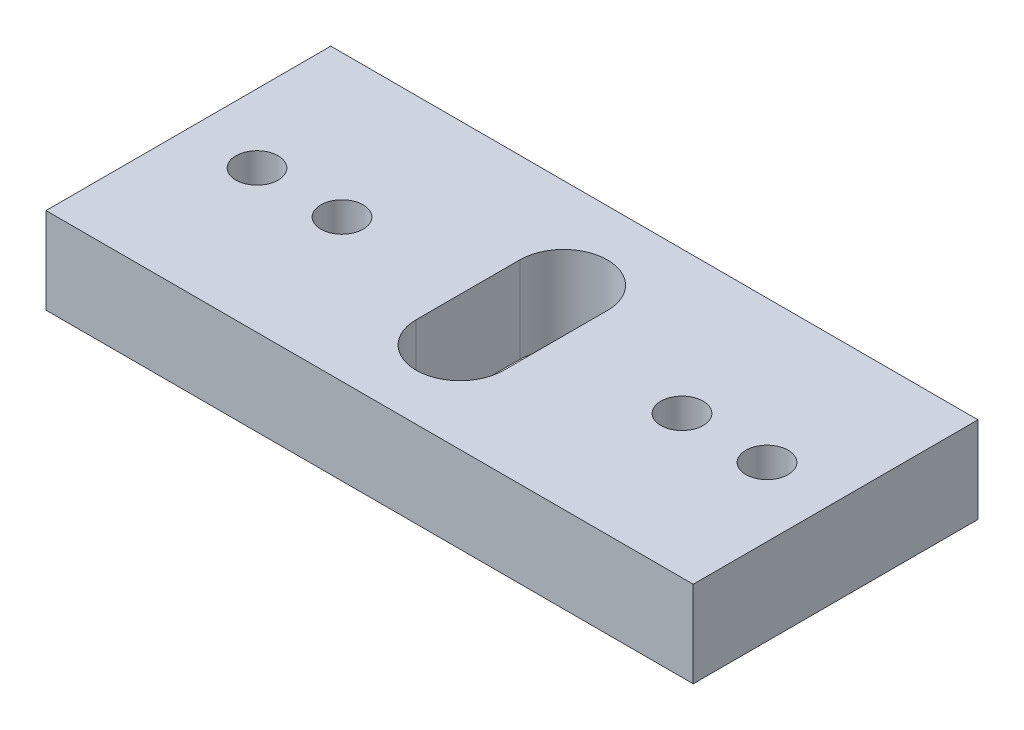
ISO-10303-21;
HEADER;
FILE_DESCRIPTION(('STEP AP214'),'2;1');
FILE_NAME('part.step','',(''),(''),'','','');
FILE_SCHEMA(('AUTOMOTIVE_DESIGN { 1 0 10303 214 1 1 1 1 }'));
ENDSEC;
DATA;
#1=APPLICATION_CONTEXT('core data for automotive mechanical design processes');
#2=APPLICATION_PROTOCOL_DEFINITION('international standard','automotive_design',2000,#1);
#3=PRODUCT_CONTEXT('',#1,'mechanical');
#4=PRODUCT('Part','Part','',(#3));
#5=PRODUCT_RELATED_PRODUCT_CATEGORY('part','',(#4));
#6=PRODUCT_DEFINITION_FORMATION('','',#4);
#7=PRODUCT_DEFINITION_CONTEXT('part definition',#1,'design');
#8=PRODUCT_DEFINITION('design','',#6,#7);
#9=PRODUCT_DEFINITION_SHAPE('','',#8);
#10=(LENGTH_UNIT() NAMED_UNIT(*) SI_UNIT(.MILLI.,.METRE.));
#11=(NAMED_UNIT(*) PLANE_ANGLE_UNIT() SI_UNIT($,.RADIAN.));
#12=(NAMED_UNIT(*) SI_UNIT($,.STERADIAN.) SOLID_ANGLE_UNIT());
#13=UNCERTAINTY_MEASURE_WITH_UNIT(LENGTH_MEASURE(1.E-05),#10,'distance_accuracy_value','');
#14=(GEOMETRIC_REPRESENTATION_CONTEXT(3) GLOBAL_UNCERTAINTY_ASSIGNED_CONTEXT((#13)) GLOBAL_UNIT_ASSIGNED_CONTEXT((#10,
#11,#12)) REPRESENTATION_CONTEXT('',''));
#15=CARTESIAN_POINT('',(0.,0.,0.));
#16=DIRECTION('',(0.,0.,1.));
#17=DIRECTION('',(1.,0.,0.));
#18=AXIS2_PLACEMENT_3D('',#15,#16,#17);
#19=CARTESIAN_POINT('',(0.,5.08,0.));
#20=DIRECTION('',(0.,-1.,0.));
#21=DIRECTION('',(0.,0.,-1.));
#22=AXIS2_PLACEMENT_3D('',#19,#20,#21);
#23=PLANE('',#22);
#24=CARTESIAN_POINT('',(-15.0114,5.08,0.));
#25=DIRECTION('',(0.,1.,0.));
#26=DIRECTION('',(0.,0.,1.));
#27=AXIS2_PLACEMENT_3D('',#24,#25,#26);
#28=CIRCLE('',#27,1.2446);
#29=CARTESIAN_POINT('',(-15.0114,5.08,1.2446));
#30=VERTEX_POINT('',#29);
#31=EDGE_CURVE('E137',#30,#30,#28,.T.);
#32=ORIENTED_EDGE('',*,*,#31,.F.);
#33=EDGE_LOOP('',(#32));
#34=FACE_BOUND('',#33,.T.);
#35=CARTESIAN_POINT('',(-10.0076,5.08,0.));
#36=DIRECTION('',(0.,1.,0.));
#37=DIRECTION('',(0.,0.,1.));
#38=AXIS2_PLACEMENT_3D('',#35,#36,#37);
#39=CIRCLE('',#38,1.2446);
#40=CARTESIAN_POINT('',(-10.0076,5.08,1.2446));
#41=VERTEX_POINT('',#40);
#42=EDGE_CURVE('E143',#41,#41,#39,.T.);
#43=ORIENTED_EDGE('',*,*,#42,.F.);
#44=EDGE_LOOP('',(#43));
#45=FACE_BOUND('',#44,.T.);
#46=DIRECTION('',(0.,0.,1.));
#47=VECTOR('',#46,1.);
#48=CARTESIAN_POINT('',(-19.05,5.08,-8.382));
#49=LINE('',#48,#47);
#50=CARTESIAN_POINT('',(-19.05,5.08,-8.382));
#51=VERTEX_POINT('',#50);
#52=CARTESIAN_POINT('',(-19.05,5.08,8.382));
#53=VERTEX_POINT('',#52);
#54=EDGE_CURVE('E149',#51,#53,#49,.T.);
#55=ORIENTED_EDGE('',*,*,#54,.T.);
#56=DIRECTION('',(1.,0.,0.));
#57=VECTOR('',#56,1.);
#58=CARTESIAN_POINT('',(19.05,5.08,8.382));
#59=LINE('',#58,#57);
#60=CARTESIAN_POINT('',(19.05,5.08,8.382));
#61=VERTEX_POINT('',#60);
#62=EDGE_CURVE('E152',#53,#61,#59,.T.);
#63=ORIENTED_EDGE('',*,*,#62,.T.);
#64=DIRECTION('',(0.,0.,-1.));
#65=VECTOR('',#64,1.);
#66=CARTESIAN_POINT('',(19.05,5.08,-8.382));
#67=LINE('',#66,#65);
#68=CARTESIAN_POINT('',(19.05,5.08,-8.382));
#69=VERTEX_POINT('',#68);
#70=EDGE_CURVE('E155',#61,#69,#67,.T.);
#71=ORIENTED_EDGE('',*,*,#70,.T.);
#72=DIRECTION('',(-1.,0.,0.));
#73=VECTOR('',#72,1.);
#74=CARTESIAN_POINT('',(19.05,5.08,-8.382));
#75=LINE('',#74,#73);
#76=EDGE_CURVE('E157',#69,#51,#75,.T.);
#77=ORIENTED_EDGE('',*,*,#76,.T.);
#78=EDGE_LOOP('',(#55,#63,#71,#77));
#79=FACE_BOUND('',#78,.T.);
#80=CARTESIAN_POINT('',(-0.0111125000000007,5.08,-3.048));
#81=DIRECTION('',(0.,1.,0.));
#82=DIRECTION('',(0.,0.,1.));
#83=AXIS2_PLACEMENT_3D('',#80,#81,#82);
#84=CIRCLE('',#83,2.5796875);
#85=CARTESIAN_POINT('',(2.568575,5.08,-3.048));
#86=VERTEX_POINT('',#85);
#87=CARTESIAN_POINT('',(-2.5908,5.08,-3.048));
#88=VERTEX_POINT('',#87);
#89=EDGE_CURVE('E98',#86,#88,#84,.T.);
#90=ORIENTED_EDGE('',*,*,#89,.F.);
#91=DIRECTION('',(0.,0.,-1.));
#92=VECTOR('',#91,1.);
#93=CARTESIAN_POINT('',(2.568575,5.08,3.048));
#94=LINE('',#93,#92);
#95=CARTESIAN_POINT('',(2.568575,5.08,3.048));
#96=VERTEX_POINT('',#95);
#97=EDGE_CURVE('E121',#96,#86,#94,.T.);
#98=ORIENTED_EDGE('',*,*,#97,.F.);
#99=CARTESIAN_POINT('',(-0.0111124999999999,5.08,3.048));
#100=DIRECTION('',(0.,1.,0.));
#101=DIRECTION('',(0.,0.,-1.));
#102=AXIS2_PLACEMENT_3D('',#99,#100,#101);
#103=CIRCLE('',#102,2.5796875);
#104=CARTESIAN_POINT('',(-2.5908,5.08,3.048));
#105=VERTEX_POINT('',#104);
#106=EDGE_CURVE('E119',#105,#96,#103,.T.);
#107=ORIENTED_EDGE('',*,*,#106,.F.);
#108=DIRECTION('',(0.,0.,1.));
#109=VECTOR('',#108,1.);
#110=CARTESIAN_POINT('',(-2.5908,5.08,3.048));
#111=LINE('',#110,#109);
#112=EDGE_CURVE('E106',#88,#105,#111,.T.);
#113=ORIENTED_EDGE('',*,*,#112,.F.);
#114=EDGE_LOOP('',(#90,#98,#107,#113));
#115=FACE_BOUND('',#114,.T.);
#116=CARTESIAN_POINT('',(15.0114,5.08,0.));
#117=DIRECTION('',(0.,1.,0.));
#118=DIRECTION('',(0.,0.,-1.));
#119=AXIS2_PLACEMENT_3D('',#116,#117,#118);
#120=CIRCLE('',#119,1.2446);
#121=CARTESIAN_POINT('',(15.0114,5.08,-1.2446));
#122=VERTEX_POINT('',#121);
#123=EDGE_CURVE('E127',#122,#122,#120,.T.);
#124=ORIENTED_EDGE('',*,*,#123,.F.);
#125=EDGE_LOOP('',(#124));
#126=FACE_BOUND('',#125,.T.);
#127=CARTESIAN_POINT('',(10.0076,5.08,0.));
#128=DIRECTION('',(0.,1.,0.));
#129=DIRECTION('',(0.,0.,-1.));
#130=AXIS2_PLACEMENT_3D('',#127,#128,#129);
#131=CIRCLE('',#130,1.2446);
#132=CARTESIAN_POINT('',(10.0076,5.08,-1.2446));
#133=VERTEX_POINT('',#132);
#134=EDGE_CURVE('E254',#133,#133,#131,.T.);
#135=ORIENTED_EDGE('',*,*,#134,.F.);
#136=EDGE_LOOP('',(#135));
#137=FACE_BOUND('',#136,.T.);
#138=ADVANCED_FACE('F33',(#34,#45,#79,#115,#126,#137),#23,.F.);
#139=CARTESIAN_POINT('',(0.,0.,0.));
#140=DIRECTION('',(0.,-1.,0.));
#141=DIRECTION('',(0.,0.,-1.));
#142=AXIS2_PLACEMENT_3D('',#139,#140,#141);
#143=PLANE('',#142);
#144=CARTESIAN_POINT('',(15.0114,0.,0.));
#145=DIRECTION('',(0.,1.,0.));
#146=DIRECTION('',(0.,0.,-1.));
#147=AXIS2_PLACEMENT_3D('',#144,#145,#146);
#148=CIRCLE('',#147,1.2446);
#149=CARTESIAN_POINT('',(15.0114,0.,-1.2446));
#150=VERTEX_POINT('',#149);
#151=EDGE_CURVE('E260',#150,#150,#148,.T.);
#152=ORIENTED_EDGE('',*,*,#151,.T.);
#153=EDGE_LOOP('',(#152));
#154=FACE_BOUND('',#153,.T.);
#155=CARTESIAN_POINT('',(-10.0076,0.,0.));
#156=DIRECTION('',(0.,1.,0.));
#157=DIRECTION('',(0.,0.,1.));
#158=AXIS2_PLACEMENT_3D('',#155,#156,#157);
#159=CIRCLE('',#158,1.2446);
#160=CARTESIAN_POINT('',(-10.0076,0.,1.2446));
#161=VERTEX_POINT('',#160);
#162=EDGE_CURVE('E140',#161,#161,#159,.T.);
#163=ORIENTED_EDGE('',*,*,#162,.T.);
#164=EDGE_LOOP('',(#163));
#165=FACE_BOUND('',#164,.T.);
#166=DIRECTION('',(0.,0.,1.));
#167=VECTOR('',#166,1.);
#168=CARTESIAN_POINT('',(-19.05,0.,-8.382));
#169=LINE('',#168,#167);
#170=CARTESIAN_POINT('',(-19.05,0.,-8.382));
#171=VERTEX_POINT('',#170);
#172=CARTESIAN_POINT('',(-19.05,0.,8.382));
#173=VERTEX_POINT('',#172);
#174=EDGE_CURVE('E146',#171,#173,#169,.T.);
#175=ORIENTED_EDGE('',*,*,#174,.F.);
#176=DIRECTION('',(-1.,0.,0.));
#177=VECTOR('',#176,1.);
#178=CARTESIAN_POINT('',(19.05,0.,-8.382));
#179=LINE('',#178,#177);
#180=CARTESIAN_POINT('',(19.05,0.,-8.382));
#181=VERTEX_POINT('',#180);
#182=EDGE_CURVE('E153',#181,#171,#179,.T.);
#183=ORIENTED_EDGE('',*,*,#182,.F.);
#184=DIRECTION('',(0.,0.,-1.));
#185=VECTOR('',#184,1.);
#186=CARTESIAN_POINT('',(19.05,0.,-8.382));
#187=LINE('',#186,#185);
#188=CARTESIAN_POINT('',(19.05,0.,8.382));
#189=VERTEX_POINT('',#188);
#190=EDGE_CURVE('E164',#189,#181,#187,.T.);
#191=ORIENTED_EDGE('',*,*,#190,.F.);
#192=DIRECTION('',(1.,0.,0.));
#193=VECTOR('',#192,1.);
#194=CARTESIAN_POINT('',(19.05,0.,8.382));
#195=LINE('',#194,#193);
#196=EDGE_CURVE('E162',#173,#189,#195,.T.);
#197=ORIENTED_EDGE('',*,*,#196,.F.);
#198=EDGE_LOOP('',(#175,#183,#191,#197));
#199=FACE_BOUND('',#198,.T.);
#200=CARTESIAN_POINT('',(-15.0114,0.,0.));
#201=DIRECTION('',(0.,1.,0.));
#202=DIRECTION('',(0.,0.,1.));
#203=AXIS2_PLACEMENT_3D('',#200,#201,#202);
#204=CIRCLE('',#203,1.2446);
#205=CARTESIAN_POINT('',(-15.0114,0.,1.2446));
#206=VERTEX_POINT('',#205);
#207=EDGE_CURVE('E114',#206,#206,#204,.T.);
#208=ORIENTED_EDGE('',*,*,#207,.T.);
#209=EDGE_LOOP('',(#208));
#210=FACE_BOUND('',#209,.T.);
#211=DIRECTION('',(0.,0.,-1.));
#212=VECTOR('',#211,1.);
#213=CARTESIAN_POINT('',(2.568575,0.,3.048));
#214=LINE('',#213,#212);
#215=CARTESIAN_POINT('',(2.568575,0.,3.048));
#216=VERTEX_POINT('',#215);
#217=CARTESIAN_POINT('',(2.568575,0.,-3.048));
#218=VERTEX_POINT('',#217);
#219=EDGE_CURVE('E107',#216,#218,#214,.T.);
#220=ORIENTED_EDGE('',*,*,#219,.T.);
#221=CARTESIAN_POINT('',(-0.0111125000000007,0.,-3.048));
#222=DIRECTION('',(0.,1.,0.));
#223=DIRECTION('',(0.,0.,1.));
#224=AXIS2_PLACEMENT_3D('',#221,#222,#223);
#225=CIRCLE('',#224,2.5796875);
#226=CARTESIAN_POINT('',(-2.5908,0.,-3.048));
#227=VERTEX_POINT('',#226);
#228=EDGE_CURVE('E56',#218,#227,#225,.T.);
#229=ORIENTED_EDGE('',*,*,#228,.T.);
#230=DIRECTION('',(0.,0.,1.));
#231=VECTOR('',#230,1.);
#232=CARTESIAN_POINT('',(-2.5908,0.,3.048));
#233=LINE('',#232,#231);
#234=CARTESIAN_POINT('',(-2.5908,0.,3.048));
#235=VERTEX_POINT('',#234);
#236=EDGE_CURVE('E113',#227,#235,#233,.T.);
#237=ORIENTED_EDGE('',*,*,#236,.T.);
#238=CARTESIAN_POINT('',(-0.0111124999999999,0.,3.048));
#239=DIRECTION('',(0.,1.,0.));
#240=DIRECTION('',(0.,0.,-1.));
#241=AXIS2_PLACEMENT_3D('',#238,#239,#240);
#242=CIRCLE('',#241,2.5796875);
#243=EDGE_CURVE('E129',#235,#216,#242,.T.);
#244=ORIENTED_EDGE('',*,*,#243,.T.);
#245=EDGE_LOOP('',(#220,#229,#237,#244));
#246=FACE_BOUND('',#245,.T.);
#247=CARTESIAN_POINT('',(10.0076,0.,0.));
#248=DIRECTION('',(0.,1.,0.));
#249=DIRECTION('',(0.,0.,-1.));
#250=AXIS2_PLACEMENT_3D('',#247,#248,#249);
#251=CIRCLE('',#250,1.2446);
#252=CARTESIAN_POINT('',(10.0076,0.,-1.2446));
#253=VERTEX_POINT('',#252);
#254=EDGE_CURVE('E257',#253,#253,#251,.T.);
#255=ORIENTED_EDGE('',*,*,#254,.T.);
#256=EDGE_LOOP('',(#255));
#257=FACE_BOUND('',#256,.T.);
#258=ADVANCED_FACE('F182',(#154,#165,#199,#210,#246,#257),#143,.T.);
#259=CARTESIAN_POINT('',(-19.05,5.08,-8.382));
#260=DIRECTION('',(1.,0.,0.));
#261=DIRECTION('',(0.,0.,-1.));
#262=AXIS2_PLACEMENT_3D('',#259,#260,#261);
#263=PLANE('',#262);
#264=ORIENTED_EDGE('',*,*,#174,.T.);
#265=DIRECTION('',(0.,-1.,0.));
#266=VECTOR('',#265,1.);
#267=CARTESIAN_POINT('',(-19.05,5.08,8.382));
#268=LINE('',#267,#266);
#269=EDGE_CURVE('E11',#53,#173,#268,.T.);
#270=ORIENTED_EDGE('',*,*,#269,.F.);
#271=ORIENTED_EDGE('',*,*,#54,.F.);
#272=DIRECTION('',(0.,-1.,0.));
#273=VECTOR('',#272,1.);
#274=CARTESIAN_POINT('',(-19.05,5.08,-8.382));
#275=LINE('',#274,#273);
#276=EDGE_CURVE('E159',#51,#171,#275,.T.);
#277=ORIENTED_EDGE('',*,*,#276,.T.);
#278=EDGE_LOOP('',(#264,#270,#271,#277));
#279=FACE_BOUND('',#278,.T.);
#280=ADVANCED_FACE('F35',(#279),#263,.F.);
#281=CARTESIAN_POINT('',(19.05,5.08,8.382));
#282=DIRECTION('',(0.,0.,-1.));
#283=DIRECTION('',(-1.,0.,0.));
#284=AXIS2_PLACEMENT_3D('',#281,#282,#283);
#285=PLANE('',#284);
#286=ORIENTED_EDGE('',*,*,#196,.T.);
#287=DIRECTION('',(0.,-1.,0.));
#288=VECTOR('',#287,1.);
#289=CARTESIAN_POINT('',(19.05,5.08,8.382));
#290=LINE('',#289,#288);
#291=EDGE_CURVE('E41',#61,#189,#290,.T.);
#292=ORIENTED_EDGE('',*,*,#291,.F.);
#293=ORIENTED_EDGE('',*,*,#62,.F.);
#294=ORIENTED_EDGE('',*,*,#269,.T.);
#295=EDGE_LOOP('',(#286,#292,#293,#294));
#296=FACE_BOUND('',#295,.T.);
#297=ADVANCED_FACE('F192',(#296),#285,.F.);
#298=CARTESIAN_POINT('',(19.05,5.08,-8.382));
#299=DIRECTION('',(-1.,0.,0.));
#300=DIRECTION('',(0.,0.,1.));
#301=AXIS2_PLACEMENT_3D('',#298,#299,#300);
#302=PLANE('',#301);
#303=ORIENTED_EDGE('',*,*,#190,.T.);
#304=DIRECTION('',(0.,-1.,0.));
#305=VECTOR('',#304,1.);
#306=CARTESIAN_POINT('',(19.05,5.08,-8.382));
#307=LINE('',#306,#305);
#308=EDGE_CURVE('E169',#69,#181,#307,.T.);
#309=ORIENTED_EDGE('',*,*,#308,.F.);
#310=ORIENTED_EDGE('',*,*,#70,.F.);
#311=ORIENTED_EDGE('',*,*,#291,.T.);
#312=EDGE_LOOP('',(#303,#309,#310,#311));
#313=FACE_BOUND('',#312,.T.);
#314=ADVANCED_FACE('F176',(#313),#302,.F.);
#315=CARTESIAN_POINT('',(19.05,5.08,-8.382));
#316=DIRECTION('',(0.,0.,1.));
#317=DIRECTION('',(1.,0.,0.));
#318=AXIS2_PLACEMENT_3D('',#315,#316,#317);
#319=PLANE('',#318);
#320=ORIENTED_EDGE('',*,*,#182,.T.);
#321=ORIENTED_EDGE('',*,*,#276,.F.);
#322=ORIENTED_EDGE('',*,*,#76,.F.);
#323=ORIENTED_EDGE('',*,*,#308,.T.);
#324=EDGE_LOOP('',(#320,#321,#322,#323));
#325=FACE_BOUND('',#324,.T.);
#326=ADVANCED_FACE('F186',(#325),#319,.F.);
#327=CARTESIAN_POINT('',(-10.0076,5.08,0.));
#328=DIRECTION('',(0.,-1.,0.));
#329=DIRECTION('',(0.,0.,-1.));
#330=AXIS2_PLACEMENT_3D('',#327,#328,#329);
#331=CYLINDRICAL_SURFACE('',#330,1.2446);
#332=ORIENTED_EDGE('',*,*,#42,.T.);
#333=EDGE_LOOP('',(#332));
#334=FACE_BOUND('',#333,.T.);
#335=ORIENTED_EDGE('',*,*,#162,.F.);
#336=EDGE_LOOP('',(#335));
#337=FACE_BOUND('',#336,.T.);
#338=ADVANCED_FACE('F210',(#334,#337),#331,.F.);
#339=CARTESIAN_POINT('',(-15.0114,5.08,0.));
#340=DIRECTION('',(0.,-1.,0.));
#341=DIRECTION('',(0.,0.,-1.));
#342=AXIS2_PLACEMENT_3D('',#339,#340,#341);
#343=CYLINDRICAL_SURFACE('',#342,1.2446);
#344=ORIENTED_EDGE('',*,*,#31,.T.);
#345=EDGE_LOOP('',(#344));
#346=FACE_BOUND('',#345,.T.);
#347=ORIENTED_EDGE('',*,*,#207,.F.);
#348=EDGE_LOOP('',(#347));
#349=FACE_BOUND('',#348,.T.);
#350=ADVANCED_FACE('F217',(#346,#349),#343,.F.);
#351=CARTESIAN_POINT('',(-0.0111125000000007,5.08,-3.048));
#352=DIRECTION('',(0.,-1.,0.));
#353=DIRECTION('',(0.,0.,-1.));
#354=AXIS2_PLACEMENT_3D('',#351,#352,#353);
#355=CYLINDRICAL_SURFACE('',#354,2.5796875);
#356=ORIENTED_EDGE('',*,*,#228,.F.);
#357=DIRECTION('',(0.,-1.,0.));
#358=VECTOR('',#357,1.);
#359=CARTESIAN_POINT('',(2.568575,5.08,-3.048));
#360=LINE('',#359,#358);
#361=EDGE_CURVE('E102',#86,#218,#360,.T.);
#362=ORIENTED_EDGE('',*,*,#361,.F.);
#363=ORIENTED_EDGE('',*,*,#89,.T.);
#364=DIRECTION('',(0.,-1.,0.));
#365=VECTOR('',#364,1.);
#366=CARTESIAN_POINT('',(-2.5908,5.08,-3.048));
#367=LINE('',#366,#365);
#368=EDGE_CURVE('E101',#88,#227,#367,.T.);
#369=ORIENTED_EDGE('',*,*,#368,.T.);
#370=EDGE_LOOP('',(#356,#362,#363,#369));
#371=FACE_BOUND('',#370,.T.);
#372=ADVANCED_FACE('F100',(#371),#355,.F.);
#373=CARTESIAN_POINT('',(-2.5908,5.08,3.048));
#374=DIRECTION('',(1.,0.,0.));
#375=DIRECTION('',(0.,0.,-1.));
#376=AXIS2_PLACEMENT_3D('',#373,#374,#375);
#377=PLANE('',#376);
#378=ORIENTED_EDGE('',*,*,#236,.F.);
#379=ORIENTED_EDGE('',*,*,#368,.F.);
#380=ORIENTED_EDGE('',*,*,#112,.T.);
#381=DIRECTION('',(0.,-1.,0.));
#382=VECTOR('',#381,1.);
#383=CARTESIAN_POINT('',(-2.5908,5.08,3.048));
#384=LINE('',#383,#382);
#385=EDGE_CURVE('E115',#105,#235,#384,.T.);
#386=ORIENTED_EDGE('',*,*,#385,.T.);
#387=EDGE_LOOP('',(#378,#379,#380,#386));
#388=FACE_BOUND('',#387,.T.);
#389=ADVANCED_FACE('F110',(#388),#377,.T.);
#390=CARTESIAN_POINT('',(-0.0111124999999999,5.08,3.048));
#391=DIRECTION('',(0.,-1.,0.));
#392=DIRECTION('',(0.,0.,-1.));
#393=AXIS2_PLACEMENT_3D('',#390,#391,#392);
#394=CYLINDRICAL_SURFACE('',#393,2.5796875);
#395=ORIENTED_EDGE('',*,*,#243,.F.);
#396=ORIENTED_EDGE('',*,*,#385,.F.);
#397=ORIENTED_EDGE('',*,*,#106,.T.);
#398=DIRECTION('',(0.,-1.,0.));
#399=VECTOR('',#398,1.);
#400=CARTESIAN_POINT('',(2.568575,5.08,3.048));
#401=LINE('',#400,#399);
#402=EDGE_CURVE('E48',#96,#216,#401,.T.);
#403=ORIENTED_EDGE('',*,*,#402,.T.);
#404=EDGE_LOOP('',(#395,#396,#397,#403));
#405=FACE_BOUND('',#404,.T.);
#406=ADVANCED_FACE('F235',(#405),#394,.F.);
#407=CARTESIAN_POINT('',(2.568575,5.08,3.048));
#408=DIRECTION('',(-1.,0.,0.));
#409=DIRECTION('',(0.,0.,1.));
#410=AXIS2_PLACEMENT_3D('',#407,#408,#409);
#411=PLANE('',#410);
#412=ORIENTED_EDGE('',*,*,#219,.F.);
#413=ORIENTED_EDGE('',*,*,#402,.F.);
#414=ORIENTED_EDGE('',*,*,#97,.T.);
#415=ORIENTED_EDGE('',*,*,#361,.T.);
#416=EDGE_LOOP('',(#412,#413,#414,#415));
#417=FACE_BOUND('',#416,.T.);
#418=ADVANCED_FACE('F238',(#417),#411,.T.);
#419=CARTESIAN_POINT('',(15.0114,5.08,0.));
#420=DIRECTION('',(0.,-1.,0.));
#421=DIRECTION('',(0.,0.,-1.));
#422=AXIS2_PLACEMENT_3D('',#419,#420,#421);
#423=CYLINDRICAL_SURFACE('',#422,1.2446);
#424=ORIENTED_EDGE('',*,*,#123,.T.);
#425=EDGE_LOOP('',(#424));
#426=FACE_BOUND('',#425,.T.);
#427=ORIENTED_EDGE('',*,*,#151,.F.);
#428=EDGE_LOOP('',(#427));
#429=FACE_BOUND('',#428,.T.);
#430=ADVANCED_FACE('F242',(#426,#429),#423,.F.);
#431=CARTESIAN_POINT('',(10.0076,5.08,0.));
#432=DIRECTION('',(0.,-1.,0.));
#433=DIRECTION('',(0.,0.,-1.));
#434=AXIS2_PLACEMENT_3D('',#431,#432,#433);
#435=CYLINDRICAL_SURFACE('',#434,1.2446);
#436=ORIENTED_EDGE('',*,*,#134,.T.);
#437=EDGE_LOOP('',(#436));
#438=FACE_BOUND('',#437,.T.);
#439=ORIENTED_EDGE('',*,*,#254,.F.);
#440=EDGE_LOOP('',(#439));
#441=FACE_BOUND('',#440,.T.);
#442=ADVANCED_FACE('F245',(#438,#441),#435,.F.);
#443=CLOSED_SHELL('',(#138,#258,#280,#297,#314,#326,#338,#350,#372,#389,#406,#418,#430,#442));
#444=MANIFOLD_SOLID_BREP('B2',#443);
#445=ADVANCED_BREP_SHAPE_REPRESENTATION('',(#18,#444),#14);
#446=SHAPE_DEFINITION_REPRESENTATION(#9,#445);
ENDSEC;
END-ISO-10303-21;
